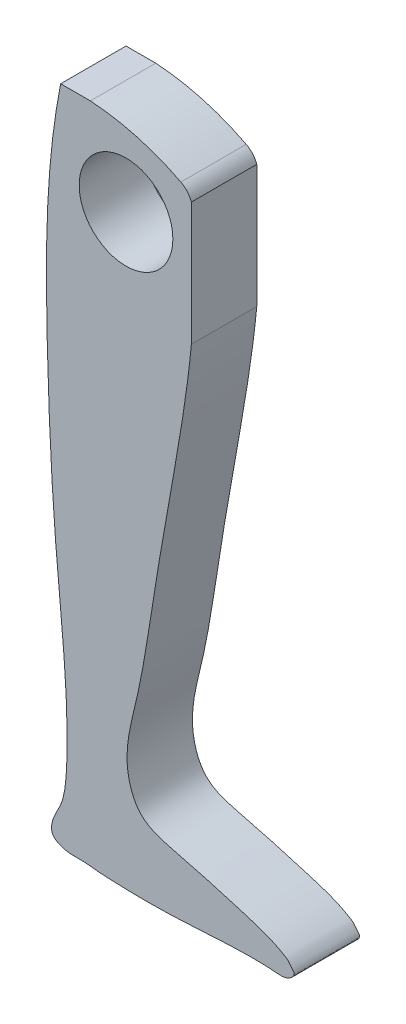
ISO-10303-21;
HEADER;
FILE_DESCRIPTION(('STEP AP214'),'2;1');
FILE_NAME('part.step','',(''),(''),'','','');
FILE_SCHEMA(('AUTOMOTIVE_DESIGN { 1 0 10303 214 1 1 1 1 }'));
ENDSEC;
DATA;
#1=APPLICATION_CONTEXT('core data for automotive mechanical design processes');
#2=APPLICATION_PROTOCOL_DEFINITION('international standard','automotive_design',2000,#1);
#3=PRODUCT_CONTEXT('',#1,'mechanical');
#4=PRODUCT('Part','Part','',(#3));
#5=PRODUCT_RELATED_PRODUCT_CATEGORY('part','',(#4));
#6=PRODUCT_DEFINITION_FORMATION('','',#4);
#7=PRODUCT_DEFINITION_CONTEXT('part definition',#1,'design');
#8=PRODUCT_DEFINITION('design','',#6,#7);
#9=PRODUCT_DEFINITION_SHAPE('','',#8);
#10=(LENGTH_UNIT() NAMED_UNIT(*) SI_UNIT(.MILLI.,.METRE.));
#11=(NAMED_UNIT(*) PLANE_ANGLE_UNIT() SI_UNIT($,.RADIAN.));
#12=(NAMED_UNIT(*) SI_UNIT($,.STERADIAN.) SOLID_ANGLE_UNIT());
#13=UNCERTAINTY_MEASURE_WITH_UNIT(LENGTH_MEASURE(1.E-05),#10,'distance_accuracy_value','');
#14=(GEOMETRIC_REPRESENTATION_CONTEXT(3) GLOBAL_UNCERTAINTY_ASSIGNED_CONTEXT((#13)) GLOBAL_UNIT_ASSIGNED_CONTEXT((#10,
#11,#12)) REPRESENTATION_CONTEXT('',''));
#15=CARTESIAN_POINT('',(0.,0.,0.));
#16=DIRECTION('',(0.,0.,1.));
#17=DIRECTION('',(1.,0.,0.));
#18=AXIS2_PLACEMENT_3D('',#15,#16,#17);
#19=CARTESIAN_POINT('',(0.,0.,3.));
#20=CARTESIAN_POINT('',(-0.691116011233822,-3.4730987105531,3.));
#21=CARTESIAN_POINT('',(-0.707043286883399,-9.79719013174978,3.));
#22=CARTESIAN_POINT('',(-0.307408847016823,-18.6561087177254,3.));
#23=CARTESIAN_POINT('',(0.387493557923686,-24.2948355606956,3.));
#24=CARTESIAN_POINT('',(0.254434786636939,-27.5582548232276,3.));
#25=CARTESIAN_POINT('',(0.121404256318541,-28.579616794444,3.));
#26=CARTESIAN_POINT('',(-0.379389945452859,-29.3088135553839,3.));
#27=CARTESIAN_POINT('',(-0.471578307201914,-30.0261607977388,3.));
#28=CARTESIAN_POINT('',(0.24204639163216,-30.4639786823385,3.));
#29=CARTESIAN_POINT('',(0.931480690840338,-30.347169010454,3.));
#30=CARTESIAN_POINT('',(1.63213130522155,-30.4503370504181,3.));
#31=CARTESIAN_POINT('',(2.82097078146724,-30.5152833580249,3.));
#32=CARTESIAN_POINT('',(5.35536682436939,-30.5708213409299,3.));
#33=CARTESIAN_POINT('',(7.91479255376896,-30.2924196497693,3.));
#34=CARTESIAN_POINT('',(9.81617806060757,-30.3616288022395,3.));
#35=CARTESIAN_POINT('',(10.3747615966799,-30.4438800513703,3.));
#36=CARTESIAN_POINT('',(10.8031309787197,-30.0515951137171,3.));
#37=CARTESIAN_POINT('',(10.5784504029966,-29.8094692392117,3.));
#38=CARTESIAN_POINT('',(10.4580984232388,-29.6305179532773,3.));
#39=CARTESIAN_POINT('',(9.74203972526426,-29.1751593466881,3.));
#40=CARTESIAN_POINT('',(8.03059752768143,-28.6416422380267,3.));
#41=CARTESIAN_POINT('',(5.87626787109094,-28.0190058190048,3.));
#42=CARTESIAN_POINT('',(3.63493925005318,-27.5205292718142,3.));
#43=CARTESIAN_POINT('',(2.7741230785153,-25.3368603508164,3.));
#44=CARTESIAN_POINT('',(3.67552464857822,-22.3208683305931,3.));
#45=CARTESIAN_POINT('',(4.25861663881811,-18.0944559884743,3.));
#46=CARTESIAN_POINT('',(5.18922461346406,-12.9607598762304,3.));
#47=CARTESIAN_POINT('',(6.11747475563733,-7.5442022334204,3.));
#48=CARTESIAN_POINT('',(6.21864906588256,-3.76709791786096,3.));
#49=CARTESIAN_POINT('',(6.05436880214285,-1.94863068663819,3.));
#50=B_SPLINE_CURVE_WITH_KNOTS('',3,(#19,#20,#21,#22,#23,#24,#25,#26,#27,#28,#29,#30,#31,#32,#33,
#34,#35,#36,#37,#38,#39,#40,#41,#42,#43,#44,#45,#46,#47,#48,#49),.UNSPECIFIED.,.F.,.F.,(4,1,1,1,
1,1,1,1,1,1,1,1,1,1,1,1,1,1,1,1,1,1,1,1,1,1,1,1,4),(0.,0.140411162303279,0.250881911254275,
0.354065851895503,0.364890775201137,0.381699906088746,0.393575398821413,0.400647102527355,
0.406820295382004,0.423093676734651,0.427756195788262,0.434983008611118,0.470514087012199,
0.528627145637454,0.537310011120331,0.546082433471383,0.551291913592737,0.55392033138465,
0.557660090365558,0.560135786220237,0.587167248946001,0.628172245408949,0.6528000752918,
0.671011982029761,0.713581820169626,0.774572908490422,0.842137069316478,0.921181085145322,
0.992983152051176),.UNSPECIFIED.);
#51=DIRECTION('',(0.,0.,-1.));
#52=VECTOR('',#51,1.);
#53=SURFACE_OF_LINEAR_EXTRUSION('',#50,#52);
#54=CARTESIAN_POINT('',(0.,0.,0.));
#55=CARTESIAN_POINT('',(-0.691116011233822,-3.4730987105531,0.));
#56=CARTESIAN_POINT('',(-0.707043286883399,-9.79719013174978,0.));
#57=CARTESIAN_POINT('',(-0.307408847016823,-18.6561087177254,0.));
#58=CARTESIAN_POINT('',(0.387493557923686,-24.2948355606956,0.));
#59=CARTESIAN_POINT('',(0.254434786636939,-27.5582548232276,0.));
#60=CARTESIAN_POINT('',(0.121404256318541,-28.579616794444,0.));
#61=CARTESIAN_POINT('',(-0.379389945452859,-29.3088135553839,0.));
#62=CARTESIAN_POINT('',(-0.471578307201914,-30.0261607977388,0.));
#63=CARTESIAN_POINT('',(0.24204639163216,-30.4639786823385,0.));
#64=CARTESIAN_POINT('',(0.931480690840338,-30.347169010454,0.));
#65=CARTESIAN_POINT('',(1.63213130522155,-30.4503370504181,0.));
#66=CARTESIAN_POINT('',(2.82097078146724,-30.5152833580249,0.));
#67=CARTESIAN_POINT('',(5.35536682436939,-30.5708213409299,0.));
#68=CARTESIAN_POINT('',(7.91479255376896,-30.2924196497693,0.));
#69=CARTESIAN_POINT('',(9.81617806060757,-30.3616288022395,0.));
#70=CARTESIAN_POINT('',(10.3747615966799,-30.4438800513703,0.));
#71=CARTESIAN_POINT('',(10.8031309787197,-30.0515951137171,0.));
#72=CARTESIAN_POINT('',(10.5784504029966,-29.8094692392117,0.));
#73=CARTESIAN_POINT('',(10.4580984232388,-29.6305179532773,0.));
#74=CARTESIAN_POINT('',(9.74203972526426,-29.1751593466881,0.));
#75=CARTESIAN_POINT('',(8.03059752768143,-28.6416422380267,0.));
#76=CARTESIAN_POINT('',(5.87626787109094,-28.0190058190048,0.));
#77=CARTESIAN_POINT('',(3.63493925005318,-27.5205292718142,0.));
#78=CARTESIAN_POINT('',(2.7741230785153,-25.3368603508164,0.));
#79=CARTESIAN_POINT('',(3.67552464857822,-22.3208683305931,0.));
#80=CARTESIAN_POINT('',(4.25861663881811,-18.0944559884743,0.));
#81=CARTESIAN_POINT('',(5.18922461346406,-12.9607598762304,0.));
#82=CARTESIAN_POINT('',(6.11747475563733,-7.5442022334204,0.));
#83=CARTESIAN_POINT('',(6.21864906588256,-3.76709791786096,0.));
#84=CARTESIAN_POINT('',(6.05436880214285,-1.94863068663819,0.));
#85=B_SPLINE_CURVE_WITH_KNOTS('',3,(#54,#55,#56,#57,#58,#59,#60,#61,#62,#63,#64,#65,#66,#67,#68,
#69,#70,#71,#72,#73,#74,#75,#76,#77,#78,#79,#80,#81,#82,#83,#84),.UNSPECIFIED.,.F.,.F.,(4,1,1,1,
1,1,1,1,1,1,1,1,1,1,1,1,1,1,1,1,1,1,1,1,1,1,1,1,4),(0.,0.140411162303279,0.250881911254275,
0.354065851895503,0.364890775201137,0.381699906088746,0.393575398821413,0.400647102527355,
0.406820295382004,0.423093676734651,0.427756195788262,0.434983008611118,0.470514087012199,
0.528627145637454,0.537310011120331,0.546082433471383,0.551291913592737,0.55392033138465,
0.557660090365558,0.560135786220237,0.587167248946001,0.628172245408949,0.6528000752918,
0.671011982029761,0.713581820169626,0.774572908490422,0.842137069316478,0.921181085145322,
0.992983152051176),.UNSPECIFIED.);
#86=CARTESIAN_POINT('',(0.,0.,0.));
#87=VERTEX_POINT('',#86);
#88=CARTESIAN_POINT('',(6.,-7.35468107941824,0.));
#89=VERTEX_POINT('',#88);
#90=EDGE_CURVE('E114',#87,#89,#85,.T.);
#91=ORIENTED_EDGE('',*,*,#90,.T.);
#92=DIRECTION('',(0.,0.,-1.));
#93=VECTOR('',#92,1.);
#94=CARTESIAN_POINT('',(6.,-7.35468107941824,3.));
#95=LINE('',#94,#93);
#96=CARTESIAN_POINT('',(6.,-7.35468107941824,3.));
#97=VERTEX_POINT('',#96);
#98=EDGE_CURVE('E11',#97,#89,#95,.T.);
#99=ORIENTED_EDGE('',*,*,#98,.F.);
#100=CARTESIAN_POINT('',(0.,0.,3.));
#101=VERTEX_POINT('',#100);
#102=EDGE_CURVE('E81',#101,#97,#50,.T.);
#103=ORIENTED_EDGE('',*,*,#102,.F.);
#104=DIRECTION('',(0.,0.,-1.));
#105=VECTOR('',#104,1.);
#106=CARTESIAN_POINT('',(0.,0.,3.));
#107=LINE('',#106,#105);
#108=EDGE_CURVE('E52',#101,#87,#107,.T.);
#109=ORIENTED_EDGE('',*,*,#108,.T.);
#110=EDGE_LOOP('',(#91,#99,#103,#109));
#111=FACE_BOUND('',#110,.T.);
#112=ADVANCED_FACE('F35',(#111),#53,.F.);
#113=CARTESIAN_POINT('',(6.,0.,3.));
#114=DIRECTION('',(1.,0.,0.));
#115=DIRECTION('',(0.,1.,0.));
#116=AXIS2_PLACEMENT_3D('',#113,#114,#115);
#117=PLANE('',#116);
#118=DIRECTION('',(0.,-1.,0.));
#119=VECTOR('',#118,1.);
#120=CARTESIAN_POINT('',(6.,0.,0.));
#121=LINE('',#120,#119);
#122=CARTESIAN_POINT('',(6.,-1.70180184641259,0.));
#123=VERTEX_POINT('',#122);
#124=EDGE_CURVE('E118',#123,#89,#121,.T.);
#125=ORIENTED_EDGE('',*,*,#124,.F.);
#126=DIRECTION('',(0.,0.,-1.));
#127=VECTOR('',#126,1.);
#128=CARTESIAN_POINT('',(6.,-1.70180184641259,3.));
#129=LINE('',#128,#127);
#130=CARTESIAN_POINT('',(6.,-1.70180184641259,3.));
#131=VERTEX_POINT('',#130);
#132=EDGE_CURVE('E44',#131,#123,#129,.T.);
#133=ORIENTED_EDGE('',*,*,#132,.F.);
#134=DIRECTION('',(0.,-1.,0.));
#135=VECTOR('',#134,1.);
#136=CARTESIAN_POINT('',(6.,0.,3.));
#137=LINE('',#136,#135);
#138=EDGE_CURVE('E106',#131,#97,#137,.T.);
#139=ORIENTED_EDGE('',*,*,#138,.T.);
#140=ORIENTED_EDGE('',*,*,#98,.T.);
#141=EDGE_LOOP('',(#125,#133,#139,#140));
#142=FACE_BOUND('',#141,.T.);
#143=ADVANCED_FACE('F136',(#142),#117,.T.);
#144=CARTESIAN_POINT('',(5.05842464772627,-2.03860424543999,3.));
#145=DIRECTION('',(0.,0.,-1.));
#146=DIRECTION('',(-1.,0.,0.));
#147=AXIS2_PLACEMENT_3D('',#144,#145,#146);
#148=CYLINDRICAL_SURFACE('',#147,1.);
#149=CARTESIAN_POINT('',(5.05842464772627,-2.03860424543999,0.));
#150=DIRECTION('',(0.,0.,1.));
#151=DIRECTION('',(1.,0.,0.));
#152=AXIS2_PLACEMENT_3D('',#149,#150,#151);
#153=CIRCLE('',#152,1.);
#154=CARTESIAN_POINT('',(5.51624498227071,-1.14955951018893,0.));
#155=VERTEX_POINT('',#154);
#156=EDGE_CURVE('E95',#155,#123,#153,.F.);
#157=ORIENTED_EDGE('',*,*,#156,.F.);
#158=DIRECTION('',(0.,0.,-1.));
#159=VECTOR('',#158,1.);
#160=CARTESIAN_POINT('',(5.51624498227071,-1.14955951018893,3.));
#161=LINE('',#160,#159);
#162=CARTESIAN_POINT('',(5.51624498227071,-1.14955951018893,3.));
#163=VERTEX_POINT('',#162);
#164=EDGE_CURVE('E89',#163,#155,#161,.T.);
#165=ORIENTED_EDGE('',*,*,#164,.F.);
#166=CARTESIAN_POINT('',(5.05842464772627,-2.03860424543999,3.));
#167=DIRECTION('',(0.,0.,1.));
#168=DIRECTION('',(1.,0.,0.));
#169=AXIS2_PLACEMENT_3D('',#166,#167,#168);
#170=CIRCLE('',#169,1.);
#171=EDGE_CURVE('E93',#163,#131,#170,.F.);
#172=ORIENTED_EDGE('',*,*,#171,.T.);
#173=ORIENTED_EDGE('',*,*,#132,.T.);
#174=EDGE_LOOP('',(#157,#165,#172,#173));
#175=FACE_BOUND('',#174,.T.);
#176=ADVANCED_FACE('F91',(#175),#148,.T.);
#177=CARTESIAN_POINT('',(0.681996012381099,-10.5372237777665,3.));
#178=DIRECTION('',(0.,0.,-1.));
#179=DIRECTION('',(-1.,0.,0.));
#180=AXIS2_PLACEMENT_3D('',#177,#178,#179);
#181=CYLINDRICAL_SURFACE('',#180,10.5592709740602);
#182=CARTESIAN_POINT('',(0.681996012381099,-10.5372237777665,0.));
#183=DIRECTION('',(0.,0.,1.));
#184=DIRECTION('',(1.,0.,0.));
#185=AXIS2_PLACEMENT_3D('',#182,#183,#184);
#186=CIRCLE('',#185,10.5592709740602);
#187=CARTESIAN_POINT('',(1.3639920247622,0.,0.));
#188=VERTEX_POINT('',#187);
#189=EDGE_CURVE('E125',#155,#188,#186,.T.);
#190=ORIENTED_EDGE('',*,*,#189,.T.);
#191=DIRECTION('',(0.,0.,-1.));
#192=VECTOR('',#191,1.);
#193=CARTESIAN_POINT('',(1.3639920247622,0.,3.));
#194=LINE('',#193,#192);
#195=CARTESIAN_POINT('',(1.3639920247622,0.,3.));
#196=VERTEX_POINT('',#195);
#197=EDGE_CURVE('E69',#196,#188,#194,.T.);
#198=ORIENTED_EDGE('',*,*,#197,.F.);
#199=CARTESIAN_POINT('',(0.681996012381099,-10.5372237777665,3.));
#200=DIRECTION('',(0.,0.,1.));
#201=DIRECTION('',(1.,0.,0.));
#202=AXIS2_PLACEMENT_3D('',#199,#200,#201);
#203=CIRCLE('',#202,10.5592709740602);
#204=EDGE_CURVE('E99',#163,#196,#203,.T.);
#205=ORIENTED_EDGE('',*,*,#204,.F.);
#206=ORIENTED_EDGE('',*,*,#164,.T.);
#207=EDGE_LOOP('',(#190,#198,#205,#206));
#208=FACE_BOUND('',#207,.T.);
#209=ADVANCED_FACE('F100',(#208),#181,.T.);
#210=CARTESIAN_POINT('',(0.,0.,3.));
#211=DIRECTION('',(0.,1.,0.));
#212=DIRECTION('',(0.,0.,1.));
#213=AXIS2_PLACEMENT_3D('',#210,#211,#212);
#214=PLANE('',#213);
#215=DIRECTION('',(1.,0.,0.));
#216=VECTOR('',#215,1.);
#217=CARTESIAN_POINT('',(0.,0.,0.));
#218=LINE('',#217,#216);
#219=EDGE_CURVE('E127',#87,#188,#218,.T.);
#220=ORIENTED_EDGE('',*,*,#219,.F.);
#221=ORIENTED_EDGE('',*,*,#108,.F.);
#222=DIRECTION('',(1.,0.,0.));
#223=VECTOR('',#222,1.);
#224=CARTESIAN_POINT('',(0.,0.,3.));
#225=LINE('',#224,#223);
#226=EDGE_CURVE('E101',#101,#196,#225,.T.);
#227=ORIENTED_EDGE('',*,*,#226,.T.);
#228=ORIENTED_EDGE('',*,*,#197,.T.);
#229=EDGE_LOOP('',(#220,#221,#227,#228));
#230=FACE_BOUND('',#229,.T.);
#231=ADVANCED_FACE('F140',(#230),#214,.T.);
#232=CARTESIAN_POINT('',(3.,-3.6,3.));
#233=DIRECTION('',(0.,0.,-1.));
#234=DIRECTION('',(-1.,0.,0.));
#235=AXIS2_PLACEMENT_3D('',#232,#233,#234);
#236=CYLINDRICAL_SURFACE('',#235,2.15);
#237=CARTESIAN_POINT('',(3.,-3.6,3.));
#238=DIRECTION('',(0.,0.,1.));
#239=DIRECTION('',(1.,0.,0.));
#240=AXIS2_PLACEMENT_3D('',#237,#238,#239);
#241=CIRCLE('',#240,2.15);
#242=CARTESIAN_POINT('',(5.15,-3.6,3.));
#243=VERTEX_POINT('',#242);
#244=EDGE_CURVE('E111',#243,#243,#241,.T.);
#245=ORIENTED_EDGE('',*,*,#244,.T.);
#246=EDGE_LOOP('',(#245));
#247=FACE_BOUND('',#246,.T.);
#248=CARTESIAN_POINT('',(3.,-3.6,0.));
#249=DIRECTION('',(0.,0.,1.));
#250=DIRECTION('',(1.,0.,0.));
#251=AXIS2_PLACEMENT_3D('',#248,#249,#250);
#252=CIRCLE('',#251,2.15);
#253=CARTESIAN_POINT('',(5.15,-3.6,0.));
#254=VERTEX_POINT('',#253);
#255=EDGE_CURVE('E130',#254,#254,#252,.T.);
#256=ORIENTED_EDGE('',*,*,#255,.F.);
#257=EDGE_LOOP('',(#256));
#258=FACE_BOUND('',#257,.T.);
#259=ADVANCED_FACE('F142',(#247,#258),#236,.F.);
#260=CARTESIAN_POINT('',(0.,0.,3.));
#261=DIRECTION('',(0.,0.,1.));
#262=DIRECTION('',(1.,0.,0.));
#263=AXIS2_PLACEMENT_3D('',#260,#261,#262);
#264=PLANE('',#263);
#265=ORIENTED_EDGE('',*,*,#102,.T.);
#266=ORIENTED_EDGE('',*,*,#138,.F.);
#267=ORIENTED_EDGE('',*,*,#171,.F.);
#268=ORIENTED_EDGE('',*,*,#204,.T.);
#269=ORIENTED_EDGE('',*,*,#226,.F.);
#270=EDGE_LOOP('',(#265,#266,#267,#268,#269));
#271=FACE_BOUND('',#270,.T.);
#272=ORIENTED_EDGE('',*,*,#244,.F.);
#273=EDGE_LOOP('',(#272));
#274=FACE_BOUND('',#273,.T.);
#275=ADVANCED_FACE('F103',(#271,#274),#264,.T.);
#276=CARTESIAN_POINT('',(0.,0.,0.));
#277=DIRECTION('',(0.,0.,1.));
#278=DIRECTION('',(1.,0.,0.));
#279=AXIS2_PLACEMENT_3D('',#276,#277,#278);
#280=PLANE('',#279);
#281=ORIENTED_EDGE('',*,*,#90,.F.);
#282=ORIENTED_EDGE('',*,*,#219,.T.);
#283=ORIENTED_EDGE('',*,*,#189,.F.);
#284=ORIENTED_EDGE('',*,*,#156,.T.);
#285=ORIENTED_EDGE('',*,*,#124,.T.);
#286=EDGE_LOOP('',(#281,#282,#283,#284,#285));
#287=FACE_BOUND('',#286,.T.);
#288=ORIENTED_EDGE('',*,*,#255,.T.);
#289=EDGE_LOOP('',(#288));
#290=FACE_BOUND('',#289,.T.);
#291=ADVANCED_FACE('F138',(#287,#290),#280,.F.);
#292=CLOSED_SHELL('',(#112,#143,#176,#209,#231,#259,#275,#291));
#293=MANIFOLD_SOLID_BREP('B2',#292);
#294=ADVANCED_BREP_SHAPE_REPRESENTATION('',(#18,#293),#14);
#295=SHAPE_DEFINITION_REPRESENTATION(#9,#294);
ENDSEC;
END-ISO-10303-21;
